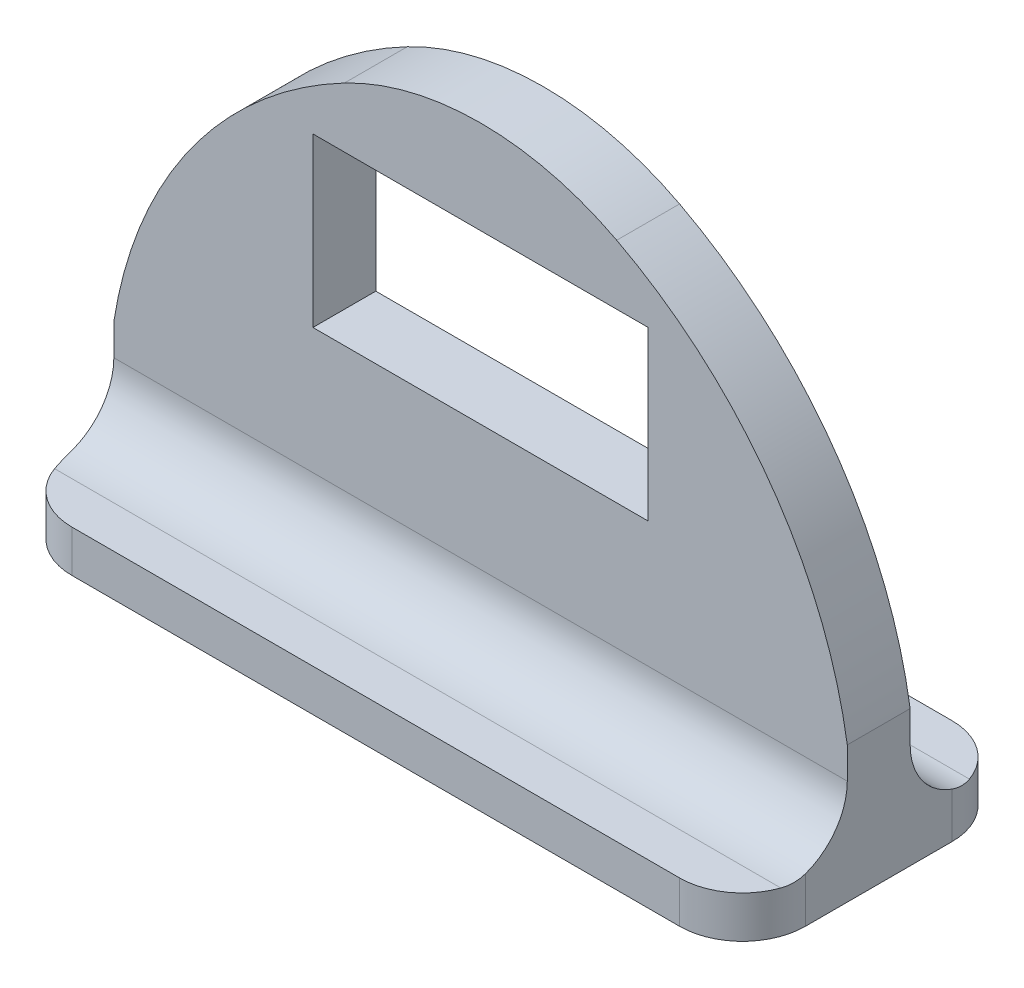
ISO-10303-21;
HEADER;
FILE_DESCRIPTION(('STEP AP214'),'2;1');
FILE_NAME('part.step','',(''),(''),'','','');
FILE_SCHEMA(('AUTOMOTIVE_DESIGN { 1 0 10303 214 1 1 1 1 }'));
ENDSEC;
DATA;
#1=APPLICATION_CONTEXT('core data for automotive mechanical design processes');
#2=APPLICATION_PROTOCOL_DEFINITION('international standard','automotive_design',2000,#1);
#3=PRODUCT_CONTEXT('',#1,'mechanical');
#4=PRODUCT('Part','Part','',(#3));
#5=PRODUCT_RELATED_PRODUCT_CATEGORY('part','',(#4));
#6=PRODUCT_DEFINITION_FORMATION('','',#4);
#7=PRODUCT_DEFINITION_CONTEXT('part definition',#1,'design');
#8=PRODUCT_DEFINITION('design','',#6,#7);
#9=PRODUCT_DEFINITION_SHAPE('','',#8);
#10=(LENGTH_UNIT() NAMED_UNIT(*) SI_UNIT(.MILLI.,.METRE.));
#11=(NAMED_UNIT(*) PLANE_ANGLE_UNIT() SI_UNIT($,.RADIAN.));
#12=(NAMED_UNIT(*) SI_UNIT($,.STERADIAN.) SOLID_ANGLE_UNIT());
#13=UNCERTAINTY_MEASURE_WITH_UNIT(LENGTH_MEASURE(1.E-05),#10,'distance_accuracy_value','');
#14=(GEOMETRIC_REPRESENTATION_CONTEXT(3) GLOBAL_UNCERTAINTY_ASSIGNED_CONTEXT((#13)) GLOBAL_UNIT_ASSIGNED_CONTEXT((#10,
#11,#12)) REPRESENTATION_CONTEXT('',''));
#15=CARTESIAN_POINT('',(0.,0.,0.));
#16=DIRECTION('',(0.,0.,1.));
#17=DIRECTION('',(1.,0.,0.));
#18=AXIS2_PLACEMENT_3D('',#15,#16,#17);
#19=CARTESIAN_POINT('',(0.,0.,0.));
#20=DIRECTION('',(0.,0.,1.));
#21=DIRECTION('',(1.,0.,0.));
#22=AXIS2_PLACEMENT_3D('',#19,#20,#21);
#23=PLANE('',#22);
#24=DIRECTION('',(1.,0.,0.));
#25=VECTOR('',#24,1.);
#26=CARTESIAN_POINT('',(0.,48.26,0.));
#27=LINE('',#26,#25);
#28=CARTESIAN_POINT('',(-20.32,48.26,0.));
#29=VERTEX_POINT('',#28);
#30=CARTESIAN_POINT('',(20.32,48.26,0.));
#31=VERTEX_POINT('',#30);
#32=EDGE_CURVE('E204',#29,#31,#27,.T.);
#33=ORIENTED_EDGE('',*,*,#32,.F.);
#34=DIRECTION('',(0.,-1.,0.));
#35=VECTOR('',#34,1.);
#36=CARTESIAN_POINT('',(-20.32,0.,0.));
#37=LINE('',#36,#35);
#38=CARTESIAN_POINT('',(-20.32,27.94,0.));
#39=VERTEX_POINT('',#38);
#40=EDGE_CURVE('E353',#29,#39,#37,.T.);
#41=ORIENTED_EDGE('',*,*,#40,.T.);
#42=DIRECTION('',(1.,0.,0.));
#43=VECTOR('',#42,1.);
#44=CARTESIAN_POINT('',(0.,27.94,0.));
#45=LINE('',#44,#43);
#46=CARTESIAN_POINT('',(20.32,27.94,0.));
#47=VERTEX_POINT('',#46);
#48=EDGE_CURVE('E350',#39,#47,#45,.T.);
#49=ORIENTED_EDGE('',*,*,#48,.T.);
#50=DIRECTION('',(0.,-1.,0.));
#51=VECTOR('',#50,1.);
#52=CARTESIAN_POINT('',(20.32,0.,0.));
#53=LINE('',#52,#51);
#54=EDGE_CURVE('E348',#31,#47,#53,.T.);
#55=ORIENTED_EDGE('',*,*,#54,.F.);
#56=EDGE_LOOP('',(#33,#41,#49,#55));
#57=FACE_BOUND('',#56,.T.);
#58=DIRECTION('',(0.,1.,0.));
#59=VECTOR('',#58,1.);
#60=CARTESIAN_POINT('',(44.45,0.,0.));
#61=LINE('',#60,#59);
#62=CARTESIAN_POINT('',(44.45,12.7,0.));
#63=VERTEX_POINT('',#62);
#64=CARTESIAN_POINT('',(44.45,16.5100000000001,0.));
#65=VERTEX_POINT('',#64);
#66=EDGE_CURVE('E200',#63,#65,#61,.T.);
#67=ORIENTED_EDGE('',*,*,#66,.F.);
#68=DIRECTION('',(1.,0.,0.));
#69=VECTOR('',#68,1.);
#70=CARTESIAN_POINT('',(-44.45,12.7,0.));
#71=LINE('',#70,#69);
#72=CARTESIAN_POINT('',(-44.45,12.7,0.));
#73=VERTEX_POINT('',#72);
#74=EDGE_CURVE('E217',#63,#73,#71,.F.);
#75=ORIENTED_EDGE('',*,*,#74,.T.);
#76=DIRECTION('',(0.,1.,0.));
#77=VECTOR('',#76,1.);
#78=CARTESIAN_POINT('',(-44.45,0.,0.));
#79=LINE('',#78,#77);
#80=CARTESIAN_POINT('',(-44.45,16.5099999999992,0.));
#81=VERTEX_POINT('',#80);
#82=EDGE_CURVE('E365',#73,#81,#79,.T.);
#83=ORIENTED_EDGE('',*,*,#82,.T.);
#84=CARTESIAN_POINT('',(8.25500000000054,8.25499999999961,0.));
#85=DIRECTION('',(0.,0.,1.));
#86=DIRECTION('',(1.,0.,0.));
#87=AXIS2_PLACEMENT_3D('',#84,#85,#86);
#88=CIRCLE('',#87,53.3475589882054);
#89=CARTESIAN_POINT('',(-16.5029839223391,55.5096747116218,0.));
#90=VERTEX_POINT('',#89);
#91=EDGE_CURVE('E362',#81,#90,#88,.F.);
#92=ORIENTED_EDGE('',*,*,#91,.T.);
#93=CARTESIAN_POINT('',(1.65485062510743E-13,24.0110220156887,0.));
#94=DIRECTION('',(0.,0.,1.));
#95=DIRECTION('',(1.,0.,0.));
#96=AXIS2_PLACEMENT_3D('',#93,#94,#95);
#97=CIRCLE('',#96,35.56);
#98=CARTESIAN_POINT('',(16.5029839223393,55.5096747116219,0.));
#99=VERTEX_POINT('',#98);
#100=EDGE_CURVE('E359',#99,#90,#97,.T.);
#101=ORIENTED_EDGE('',*,*,#100,.F.);
#102=CARTESIAN_POINT('',(-8.25499999999988,8.25500000000009,0.));
#103=DIRECTION('',(0.,0.,1.));
#104=DIRECTION('',(1.,0.,0.));
#105=AXIS2_PLACEMENT_3D('',#102,#103,#104);
#106=CIRCLE('',#105,53.3475589882048);
#107=EDGE_CURVE('E356',#99,#65,#106,.F.);
#108=ORIENTED_EDGE('',*,*,#107,.T.);
#109=EDGE_LOOP('',(#67,#75,#83,#92,#101,#108));
#110=FACE_BOUND('',#109,.T.);
#111=ADVANCED_FACE('F36',(#57,#110),#23,.F.);
#112=CARTESIAN_POINT('',(-8.25499999999988,8.25500000000009,7.62));
#113=DIRECTION('',(0.,0.,-1.));
#114=DIRECTION('',(-1.,0.,0.));
#115=AXIS2_PLACEMENT_3D('',#112,#113,#114);
#116=CYLINDRICAL_SURFACE('',#115,53.3475589882048);
#117=ORIENTED_EDGE('',*,*,#107,.F.);
#118=DIRECTION('',(0.,0.,-1.));
#119=VECTOR('',#118,1.);
#120=CARTESIAN_POINT('',(16.5029839223393,55.5096747116219,7.62));
#121=LINE('',#120,#119);
#122=CARTESIAN_POINT('',(16.5029839223393,55.5096747116219,7.62));
#123=VERTEX_POINT('',#122);
#124=EDGE_CURVE('E218',#123,#99,#121,.T.);
#125=ORIENTED_EDGE('',*,*,#124,.F.);
#126=CARTESIAN_POINT('',(-8.25499999999988,8.25500000000009,7.62));
#127=DIRECTION('',(0.,0.,1.));
#128=DIRECTION('',(1.,0.,0.));
#129=AXIS2_PLACEMENT_3D('',#126,#127,#128);
#130=CIRCLE('',#129,53.3475589882048);
#131=CARTESIAN_POINT('',(44.45,16.5100000000001,7.62));
#132=VERTEX_POINT('',#131);
#133=EDGE_CURVE('E335',#123,#132,#130,.F.);
#134=ORIENTED_EDGE('',*,*,#133,.T.);
#135=DIRECTION('',(0.,0.,-1.));
#136=VECTOR('',#135,1.);
#137=CARTESIAN_POINT('',(44.45,16.5100000000001,7.62));
#138=LINE('',#137,#136);
#139=EDGE_CURVE('E205',#132,#65,#138,.T.);
#140=ORIENTED_EDGE('',*,*,#139,.T.);
#141=EDGE_LOOP('',(#117,#125,#134,#140));
#142=FACE_BOUND('',#141,.T.);
#143=ADVANCED_FACE('F387',(#142),#116,.T.);
#144=CARTESIAN_POINT('',(1.65485062510743E-13,24.0110220156887,7.62));
#145=DIRECTION('',(0.,0.,-1.));
#146=DIRECTION('',(-1.,0.,0.));
#147=AXIS2_PLACEMENT_3D('',#144,#145,#146);
#148=CYLINDRICAL_SURFACE('',#147,35.56);
#149=ORIENTED_EDGE('',*,*,#100,.T.);
#150=DIRECTION('',(0.,0.,-1.));
#151=VECTOR('',#150,1.);
#152=CARTESIAN_POINT('',(-16.5029839223391,55.5096747116218,7.62));
#153=LINE('',#152,#151);
#154=CARTESIAN_POINT('',(-16.5029839223391,55.5096747116218,7.62));
#155=VERTEX_POINT('',#154);
#156=EDGE_CURVE('E375',#155,#90,#153,.T.);
#157=ORIENTED_EDGE('',*,*,#156,.F.);
#158=CARTESIAN_POINT('',(1.65485062510743E-13,24.0110220156887,7.62));
#159=DIRECTION('',(0.,0.,1.));
#160=DIRECTION('',(1.,0.,0.));
#161=AXIS2_PLACEMENT_3D('',#158,#159,#160);
#162=CIRCLE('',#161,35.56);
#163=EDGE_CURVE('E338',#123,#155,#162,.T.);
#164=ORIENTED_EDGE('',*,*,#163,.F.);
#165=ORIENTED_EDGE('',*,*,#124,.T.);
#166=EDGE_LOOP('',(#149,#157,#164,#165));
#167=FACE_BOUND('',#166,.T.);
#168=ADVANCED_FACE('F433',(#167),#148,.T.);
#169=CARTESIAN_POINT('',(8.25500000000054,8.25499999999961,7.62));
#170=DIRECTION('',(0.,0.,-1.));
#171=DIRECTION('',(-1.,0.,0.));
#172=AXIS2_PLACEMENT_3D('',#169,#170,#171);
#173=CYLINDRICAL_SURFACE('',#172,53.3475589882054);
#174=ORIENTED_EDGE('',*,*,#91,.F.);
#175=DIRECTION('',(0.,0.,-1.));
#176=VECTOR('',#175,1.);
#177=CARTESIAN_POINT('',(-44.45,16.5099999999992,7.62));
#178=LINE('',#177,#176);
#179=CARTESIAN_POINT('',(-44.45,16.5099999999992,7.62));
#180=VERTEX_POINT('',#179);
#181=EDGE_CURVE('E372',#180,#81,#178,.T.);
#182=ORIENTED_EDGE('',*,*,#181,.F.);
#183=CARTESIAN_POINT('',(8.25500000000054,8.25499999999961,7.62));
#184=DIRECTION('',(0.,0.,1.));
#185=DIRECTION('',(1.,0.,0.));
#186=AXIS2_PLACEMENT_3D('',#183,#184,#185);
#187=CIRCLE('',#186,53.3475589882054);
#188=EDGE_CURVE('E340',#180,#155,#187,.F.);
#189=ORIENTED_EDGE('',*,*,#188,.T.);
#190=ORIENTED_EDGE('',*,*,#156,.T.);
#191=EDGE_LOOP('',(#174,#182,#189,#190));
#192=FACE_BOUND('',#191,.T.);
#193=ADVANCED_FACE('F430',(#192),#173,.T.);
#194=CARTESIAN_POINT('',(-44.45,0.,7.62));
#195=DIRECTION('',(-1.,0.,0.));
#196=DIRECTION('',(0.,0.,1.));
#197=AXIS2_PLACEMENT_3D('',#194,#195,#196);
#198=PLANE('',#197);
#199=CARTESIAN_POINT('',(-44.45,12.7,-7.62));
#200=DIRECTION('',(-1.,0.,0.));
#201=DIRECTION('',(0.,0.,1.));
#202=AXIS2_PLACEMENT_3D('',#199,#200,#201);
#203=CIRCLE('',#202,7.62);
#204=CARTESIAN_POINT('',(-44.45,5.51579510314468,-5.08));
#205=VERTEX_POINT('',#204);
#206=EDGE_CURVE('E239',#73,#205,#203,.F.);
#207=ORIENTED_EDGE('',*,*,#206,.T.);
#208=DIRECTION('',(0.,1.,0.));
#209=VECTOR('',#208,1.);
#210=CARTESIAN_POINT('',(-44.45,0.,-5.08));
#211=LINE('',#210,#209);
#212=CARTESIAN_POINT('',(-44.45,0.,-5.08));
#213=VERTEX_POINT('',#212);
#214=EDGE_CURVE('E299',#205,#213,#211,.F.);
#215=ORIENTED_EDGE('',*,*,#214,.T.);
#216=DIRECTION('',(0.,0.,-1.));
#217=VECTOR('',#216,1.);
#218=CARTESIAN_POINT('',(-44.45,0.,7.62));
#219=LINE('',#218,#217);
#220=CARTESIAN_POINT('',(-44.45,0.,12.7));
#221=VERTEX_POINT('',#220);
#222=EDGE_CURVE('E369',#221,#213,#219,.T.);
#223=ORIENTED_EDGE('',*,*,#222,.F.);
#224=DIRECTION('',(0.,-1.,0.));
#225=VECTOR('',#224,1.);
#226=CARTESIAN_POINT('',(-44.45,5.07999999999999,12.7));
#227=LINE('',#226,#225);
#228=CARTESIAN_POINT('',(-44.45,5.51579510314453,12.7));
#229=VERTEX_POINT('',#228);
#230=EDGE_CURVE('E65',#221,#229,#227,.F.);
#231=ORIENTED_EDGE('',*,*,#230,.T.);
#232=CARTESIAN_POINT('',(-44.45,12.7,15.24));
#233=DIRECTION('',(-1.,0.,0.));
#234=DIRECTION('',(0.,0.,1.));
#235=AXIS2_PLACEMENT_3D('',#232,#233,#234);
#236=CIRCLE('',#235,7.62);
#237=CARTESIAN_POINT('',(-44.45,12.7,7.62));
#238=VERTEX_POINT('',#237);
#239=EDGE_CURVE('E298',#229,#238,#236,.F.);
#240=ORIENTED_EDGE('',*,*,#239,.T.);
#241=DIRECTION('',(0.,1.,0.));
#242=VECTOR('',#241,1.);
#243=CARTESIAN_POINT('',(-44.45,0.,7.62));
#244=LINE('',#243,#242);
#245=EDGE_CURVE('E343',#238,#180,#244,.T.);
#246=ORIENTED_EDGE('',*,*,#245,.T.);
#247=ORIENTED_EDGE('',*,*,#181,.T.);
#248=ORIENTED_EDGE('',*,*,#82,.F.);
#249=EDGE_LOOP('',(#207,#215,#223,#231,#240,#246,#247,#248));
#250=FACE_BOUND('',#249,.T.);
#251=ADVANCED_FACE('F400',(#250),#198,.T.);
#252=CARTESIAN_POINT('',(0.,0.,7.62));
#253=DIRECTION('',(0.,1.,0.));
#254=DIRECTION('',(-1.,0.,0.));
#255=AXIS2_PLACEMENT_3D('',#252,#253,#254);
#256=PLANE('',#255);
#257=DIRECTION('',(-1.,0.,0.));
#258=VECTOR('',#257,1.);
#259=CARTESIAN_POINT('',(44.45,0.,-12.7));
#260=LINE('',#259,#258);
#261=CARTESIAN_POINT('',(36.83,0.,-12.7));
#262=VERTEX_POINT('',#261);
#263=CARTESIAN_POINT('',(-36.83,0.,-12.7));
#264=VERTEX_POINT('',#263);
#265=EDGE_CURVE('E322',#262,#264,#260,.T.);
#266=ORIENTED_EDGE('',*,*,#265,.F.);
#267=CARTESIAN_POINT('',(36.83,0.,-5.08));
#268=DIRECTION('',(0.,1.,0.));
#269=DIRECTION('',(-1.,0.,0.));
#270=AXIS2_PLACEMENT_3D('',#267,#268,#269);
#271=CIRCLE('',#270,7.62);
#272=CARTESIAN_POINT('',(44.45,0.,-5.08));
#273=VERTEX_POINT('',#272);
#274=EDGE_CURVE('E255',#262,#273,#271,.F.);
#275=ORIENTED_EDGE('',*,*,#274,.T.);
#276=DIRECTION('',(0.,0.,-1.));
#277=VECTOR('',#276,1.);
#278=CARTESIAN_POINT('',(44.45,0.,7.62));
#279=LINE('',#278,#277);
#280=CARTESIAN_POINT('',(44.45,0.,12.7));
#281=VERTEX_POINT('',#280);
#282=EDGE_CURVE('E208',#281,#273,#279,.T.);
#283=ORIENTED_EDGE('',*,*,#282,.F.);
#284=CARTESIAN_POINT('',(36.83,0.,12.7));
#285=DIRECTION('',(0.,1.,0.));
#286=DIRECTION('',(-1.,0.,0.));
#287=AXIS2_PLACEMENT_3D('',#284,#285,#286);
#288=CIRCLE('',#287,7.62);
#289=CARTESIAN_POINT('',(36.83,0.,20.32));
#290=VERTEX_POINT('',#289);
#291=EDGE_CURVE('E234',#281,#290,#288,.F.);
#292=ORIENTED_EDGE('',*,*,#291,.T.);
#293=DIRECTION('',(1.,0.,0.));
#294=VECTOR('',#293,1.);
#295=CARTESIAN_POINT('',(-44.45,0.,20.32));
#296=LINE('',#295,#294);
#297=CARTESIAN_POINT('',(-36.83,0.,20.32));
#298=VERTEX_POINT('',#297);
#299=EDGE_CURVE('E323',#298,#290,#296,.T.);
#300=ORIENTED_EDGE('',*,*,#299,.F.);
#301=CARTESIAN_POINT('',(-36.83,0.,12.7));
#302=DIRECTION('',(0.,1.,0.));
#303=DIRECTION('',(-1.,0.,0.));
#304=AXIS2_PLACEMENT_3D('',#301,#302,#303);
#305=CIRCLE('',#304,7.62);
#306=EDGE_CURVE('E232',#298,#221,#305,.F.);
#307=ORIENTED_EDGE('',*,*,#306,.T.);
#308=ORIENTED_EDGE('',*,*,#222,.T.);
#309=CARTESIAN_POINT('',(-36.83,0.,-5.08));
#310=DIRECTION('',(0.,1.,0.));
#311=DIRECTION('',(-1.,0.,0.));
#312=AXIS2_PLACEMENT_3D('',#309,#310,#311);
#313=CIRCLE('',#312,7.62);
#314=EDGE_CURVE('E253',#213,#264,#313,.F.);
#315=ORIENTED_EDGE('',*,*,#314,.T.);
#316=EDGE_LOOP('',(#266,#275,#283,#292,#300,#307,#308,#315));
#317=FACE_BOUND('',#316,.T.);
#318=ADVANCED_FACE('F418',(#317),#256,.F.);
#319=CARTESIAN_POINT('',(0.,48.26,7.62));
#320=DIRECTION('',(0.,1.,0.));
#321=DIRECTION('',(0.,0.,1.));
#322=AXIS2_PLACEMENT_3D('',#319,#320,#321);
#323=PLANE('',#322);
#324=ORIENTED_EDGE('',*,*,#32,.T.);
#325=DIRECTION('',(0.,0.,-1.));
#326=VECTOR('',#325,1.);
#327=CARTESIAN_POINT('',(20.32,48.26,7.62));
#328=LINE('',#327,#326);
#329=CARTESIAN_POINT('',(20.32,48.26,7.62));
#330=VERTEX_POINT('',#329);
#331=EDGE_CURVE('E185',#330,#31,#328,.T.);
#332=ORIENTED_EDGE('',*,*,#331,.F.);
#333=DIRECTION('',(1.,0.,0.));
#334=VECTOR('',#333,1.);
#335=CARTESIAN_POINT('',(0.,48.26,7.62));
#336=LINE('',#335,#334);
#337=CARTESIAN_POINT('',(-20.32,48.26,7.62));
#338=VERTEX_POINT('',#337);
#339=EDGE_CURVE('E192',#338,#330,#336,.T.);
#340=ORIENTED_EDGE('',*,*,#339,.F.);
#341=DIRECTION('',(0.,0.,-1.));
#342=VECTOR('',#341,1.);
#343=CARTESIAN_POINT('',(-20.32,48.26,7.62));
#344=LINE('',#343,#342);
#345=EDGE_CURVE('E346',#338,#29,#344,.T.);
#346=ORIENTED_EDGE('',*,*,#345,.T.);
#347=EDGE_LOOP('',(#324,#332,#340,#346));
#348=FACE_BOUND('',#347,.T.);
#349=ADVANCED_FACE('F202',(#348),#323,.F.);
#350=CARTESIAN_POINT('',(20.32,0.,7.62));
#351=DIRECTION('',(1.,0.,0.));
#352=DIRECTION('',(0.,1.,0.));
#353=AXIS2_PLACEMENT_3D('',#350,#351,#352);
#354=PLANE('',#353);
#355=ORIENTED_EDGE('',*,*,#54,.T.);
#356=DIRECTION('',(0.,0.,-1.));
#357=VECTOR('',#356,1.);
#358=CARTESIAN_POINT('',(20.32,27.94,7.62));
#359=LINE('',#358,#357);
#360=CARTESIAN_POINT('',(20.32,27.94,7.62));
#361=VERTEX_POINT('',#360);
#362=EDGE_CURVE('E187',#361,#47,#359,.T.);
#363=ORIENTED_EDGE('',*,*,#362,.F.);
#364=DIRECTION('',(0.,-1.,0.));
#365=VECTOR('',#364,1.);
#366=CARTESIAN_POINT('',(20.32,0.,7.62));
#367=LINE('',#366,#365);
#368=EDGE_CURVE('E180',#330,#361,#367,.T.);
#369=ORIENTED_EDGE('',*,*,#368,.F.);
#370=ORIENTED_EDGE('',*,*,#331,.T.);
#371=EDGE_LOOP('',(#355,#363,#369,#370));
#372=FACE_BOUND('',#371,.T.);
#373=ADVANCED_FACE('F183',(#372),#354,.F.);
#374=CARTESIAN_POINT('',(0.,27.94,7.62));
#375=DIRECTION('',(0.,1.,0.));
#376=DIRECTION('',(0.,0.,1.));
#377=AXIS2_PLACEMENT_3D('',#374,#375,#376);
#378=PLANE('',#377);
#379=ORIENTED_EDGE('',*,*,#48,.F.);
#380=DIRECTION('',(0.,0.,-1.));
#381=VECTOR('',#380,1.);
#382=CARTESIAN_POINT('',(-20.32,27.94,7.62));
#383=LINE('',#382,#381);
#384=CARTESIAN_POINT('',(-20.32,27.94,7.62));
#385=VERTEX_POINT('',#384);
#386=EDGE_CURVE('E210',#385,#39,#383,.T.);
#387=ORIENTED_EDGE('',*,*,#386,.F.);
#388=DIRECTION('',(1.,0.,0.));
#389=VECTOR('',#388,1.);
#390=CARTESIAN_POINT('',(0.,27.94,7.62));
#391=LINE('',#390,#389);
#392=EDGE_CURVE('E191',#385,#361,#391,.T.);
#393=ORIENTED_EDGE('',*,*,#392,.T.);
#394=ORIENTED_EDGE('',*,*,#362,.T.);
#395=EDGE_LOOP('',(#379,#387,#393,#394));
#396=FACE_BOUND('',#395,.T.);
#397=ADVANCED_FACE('F383',(#396),#378,.T.);
#398=CARTESIAN_POINT('',(-20.32,0.,7.62));
#399=DIRECTION('',(1.,0.,0.));
#400=DIRECTION('',(0.,1.,0.));
#401=AXIS2_PLACEMENT_3D('',#398,#399,#400);
#402=PLANE('',#401);
#403=ORIENTED_EDGE('',*,*,#40,.F.);
#404=ORIENTED_EDGE('',*,*,#345,.F.);
#405=DIRECTION('',(0.,-1.,0.));
#406=VECTOR('',#405,1.);
#407=CARTESIAN_POINT('',(-20.32,0.,7.62));
#408=LINE('',#407,#406);
#409=EDGE_CURVE('E198',#338,#385,#408,.T.);
#410=ORIENTED_EDGE('',*,*,#409,.T.);
#411=ORIENTED_EDGE('',*,*,#386,.T.);
#412=EDGE_LOOP('',(#403,#404,#410,#411));
#413=FACE_BOUND('',#412,.T.);
#414=ADVANCED_FACE('F381',(#413),#402,.T.);
#415=CARTESIAN_POINT('',(44.45,0.,7.62));
#416=DIRECTION('',(-1.,0.,0.));
#417=DIRECTION('',(0.,0.,1.));
#418=AXIS2_PLACEMENT_3D('',#415,#416,#417);
#419=PLANE('',#418);
#420=ORIENTED_EDGE('',*,*,#282,.T.);
#421=DIRECTION('',(0.,-1.,0.));
#422=VECTOR('',#421,1.);
#423=CARTESIAN_POINT('',(44.45,0.,-5.08));
#424=LINE('',#423,#422);
#425=CARTESIAN_POINT('',(44.45,5.51579510314468,-5.08));
#426=VERTEX_POINT('',#425);
#427=EDGE_CURVE('E257',#273,#426,#424,.F.);
#428=ORIENTED_EDGE('',*,*,#427,.T.);
#429=CARTESIAN_POINT('',(44.45,12.7,-7.62));
#430=DIRECTION('',(-1.,0.,0.));
#431=DIRECTION('',(0.,0.,1.));
#432=AXIS2_PLACEMENT_3D('',#429,#430,#431);
#433=CIRCLE('',#432,7.62);
#434=EDGE_CURVE('E237',#426,#63,#433,.T.);
#435=ORIENTED_EDGE('',*,*,#434,.T.);
#436=ORIENTED_EDGE('',*,*,#66,.T.);
#437=ORIENTED_EDGE('',*,*,#139,.F.);
#438=DIRECTION('',(0.,1.,0.));
#439=VECTOR('',#438,1.);
#440=CARTESIAN_POINT('',(44.45,0.,7.62));
#441=LINE('',#440,#439);
#442=CARTESIAN_POINT('',(44.45,12.7,7.62));
#443=VERTEX_POINT('',#442);
#444=EDGE_CURVE('E309',#443,#132,#441,.T.);
#445=ORIENTED_EDGE('',*,*,#444,.F.);
#446=CARTESIAN_POINT('',(44.45,12.7,15.24));
#447=DIRECTION('',(-1.,0.,0.));
#448=DIRECTION('',(0.,0.,1.));
#449=AXIS2_PLACEMENT_3D('',#446,#447,#448);
#450=CIRCLE('',#449,7.62);
#451=CARTESIAN_POINT('',(44.45,5.51579510314453,12.7));
#452=VERTEX_POINT('',#451);
#453=EDGE_CURVE('E51',#443,#452,#450,.T.);
#454=ORIENTED_EDGE('',*,*,#453,.T.);
#455=DIRECTION('',(0.,1.,0.));
#456=VECTOR('',#455,1.);
#457=CARTESIAN_POINT('',(44.45,0.,12.7));
#458=LINE('',#457,#456);
#459=EDGE_CURVE('E57',#452,#281,#458,.F.);
#460=ORIENTED_EDGE('',*,*,#459,.T.);
#461=EDGE_LOOP('',(#420,#428,#435,#436,#437,#445,#454,#460));
#462=FACE_BOUND('',#461,.T.);
#463=ADVANCED_FACE('F306',(#462),#419,.F.);
#464=CARTESIAN_POINT('',(0.,0.,7.62));
#465=DIRECTION('',(0.,0.,1.));
#466=DIRECTION('',(1.,0.,0.));
#467=AXIS2_PLACEMENT_3D('',#464,#465,#466);
#468=PLANE('',#467);
#469=ORIENTED_EDGE('',*,*,#245,.F.);
#470=DIRECTION('',(-1.,0.,0.));
#471=VECTOR('',#470,1.);
#472=CARTESIAN_POINT('',(0.,12.7,7.62));
#473=LINE('',#472,#471);
#474=EDGE_CURVE('E245',#238,#443,#473,.F.);
#475=ORIENTED_EDGE('',*,*,#474,.T.);
#476=ORIENTED_EDGE('',*,*,#444,.T.);
#477=ORIENTED_EDGE('',*,*,#133,.F.);
#478=ORIENTED_EDGE('',*,*,#163,.T.);
#479=ORIENTED_EDGE('',*,*,#188,.F.);
#480=EDGE_LOOP('',(#469,#475,#476,#477,#478,#479));
#481=FACE_BOUND('',#480,.T.);
#482=ORIENTED_EDGE('',*,*,#339,.T.);
#483=ORIENTED_EDGE('',*,*,#368,.T.);
#484=ORIENTED_EDGE('',*,*,#392,.F.);
#485=ORIENTED_EDGE('',*,*,#409,.F.);
#486=EDGE_LOOP('',(#482,#483,#484,#485));
#487=FACE_BOUND('',#486,.T.);
#488=ADVANCED_FACE('F196',(#481,#487),#468,.T.);
#489=CARTESIAN_POINT('',(44.45,5.08,-12.7));
#490=DIRECTION('',(0.,-1.,0.));
#491=DIRECTION('',(0.,0.,-1.));
#492=AXIS2_PLACEMENT_3D('',#489,#490,#491);
#493=PLANE('',#492);
#494=DIRECTION('',(1.,0.,0.));
#495=VECTOR('',#494,1.);
#496=CARTESIAN_POINT('',(44.45,5.08,-7.62));
#497=LINE('',#496,#495);
#498=CARTESIAN_POINT('',(-44.0142048968553,5.08,-7.62));
#499=VERTEX_POINT('',#498);
#500=CARTESIAN_POINT('',(44.0142048968553,5.08,-7.62));
#501=VERTEX_POINT('',#500);
#502=EDGE_CURVE('E214',#499,#501,#497,.T.);
#503=ORIENTED_EDGE('',*,*,#502,.T.);
#504=CARTESIAN_POINT('',(36.83,5.08,-5.08));
#505=DIRECTION('',(0.,-1.,0.));
#506=DIRECTION('',(0.,0.,-1.));
#507=AXIS2_PLACEMENT_3D('',#504,#505,#506);
#508=CIRCLE('',#507,7.62);
#509=CARTESIAN_POINT('',(36.83,5.08,-12.7));
#510=VERTEX_POINT('',#509);
#511=EDGE_CURVE('E404',#501,#510,#508,.F.);
#512=ORIENTED_EDGE('',*,*,#511,.T.);
#513=DIRECTION('',(1.,0.,0.));
#514=VECTOR('',#513,1.);
#515=CARTESIAN_POINT('',(44.45,5.08,-12.7));
#516=LINE('',#515,#514);
#517=CARTESIAN_POINT('',(-36.83,5.08,-12.7));
#518=VERTEX_POINT('',#517);
#519=EDGE_CURVE('E326',#518,#510,#516,.T.);
#520=ORIENTED_EDGE('',*,*,#519,.F.);
#521=CARTESIAN_POINT('',(-36.83,5.08,-5.08));
#522=DIRECTION('',(0.,-1.,0.));
#523=DIRECTION('',(0.,0.,-1.));
#524=AXIS2_PLACEMENT_3D('',#521,#522,#523);
#525=CIRCLE('',#524,7.62);
#526=EDGE_CURVE('E405',#518,#499,#525,.F.);
#527=ORIENTED_EDGE('',*,*,#526,.T.);
#528=EDGE_LOOP('',(#503,#512,#520,#527));
#529=FACE_BOUND('',#528,.T.);
#530=ADVANCED_FACE('F411',(#529),#493,.F.);
#531=CARTESIAN_POINT('',(0.,0.,-12.7));
#532=DIRECTION('',(0.,0.,1.));
#533=DIRECTION('',(1.,0.,0.));
#534=AXIS2_PLACEMENT_3D('',#531,#532,#533);
#535=PLANE('',#534);
#536=ORIENTED_EDGE('',*,*,#519,.T.);
#537=DIRECTION('',(0.,-1.,0.));
#538=VECTOR('',#537,1.);
#539=CARTESIAN_POINT('',(36.83,0.,-12.7));
#540=LINE('',#539,#538);
#541=EDGE_CURVE('E250',#510,#262,#540,.T.);
#542=ORIENTED_EDGE('',*,*,#541,.T.);
#543=ORIENTED_EDGE('',*,*,#265,.T.);
#544=DIRECTION('',(0.,1.,0.));
#545=VECTOR('',#544,1.);
#546=CARTESIAN_POINT('',(-36.83,5.08,-12.7));
#547=LINE('',#546,#545);
#548=EDGE_CURVE('E247',#264,#518,#547,.T.);
#549=ORIENTED_EDGE('',*,*,#548,.T.);
#550=EDGE_LOOP('',(#536,#542,#543,#549));
#551=FACE_BOUND('',#550,.T.);
#552=ADVANCED_FACE('F416',(#551),#535,.F.);
#553=CARTESIAN_POINT('',(-44.45,5.07999999999999,20.32));
#554=DIRECTION('',(0.,-1.,0.));
#555=DIRECTION('',(0.,0.,-1.));
#556=AXIS2_PLACEMENT_3D('',#553,#554,#555);
#557=PLANE('',#556);
#558=CARTESIAN_POINT('',(36.83,5.07999999999999,12.7));
#559=DIRECTION('',(0.,-1.,0.));
#560=DIRECTION('',(0.,0.,-1.));
#561=AXIS2_PLACEMENT_3D('',#558,#559,#560);
#562=CIRCLE('',#561,7.62);
#563=CARTESIAN_POINT('',(36.83,5.07999999999999,20.32));
#564=VERTEX_POINT('',#563);
#565=CARTESIAN_POINT('',(44.0142048968553,5.07999999999999,15.24));
#566=VERTEX_POINT('',#565);
#567=EDGE_CURVE('E228',#564,#566,#562,.F.);
#568=ORIENTED_EDGE('',*,*,#567,.T.);
#569=DIRECTION('',(-1.,0.,0.));
#570=VECTOR('',#569,1.);
#571=CARTESIAN_POINT('',(-44.45,5.07999999999999,15.24));
#572=LINE('',#571,#570);
#573=CARTESIAN_POINT('',(-44.0142048968553,5.07999999999999,15.24));
#574=VERTEX_POINT('',#573);
#575=EDGE_CURVE('E242',#566,#574,#572,.T.);
#576=ORIENTED_EDGE('',*,*,#575,.T.);
#577=CARTESIAN_POINT('',(-36.83,5.07999999999999,12.7));
#578=DIRECTION('',(0.,-1.,0.));
#579=DIRECTION('',(0.,0.,-1.));
#580=AXIS2_PLACEMENT_3D('',#577,#578,#579);
#581=CIRCLE('',#580,7.62);
#582=CARTESIAN_POINT('',(-36.83,5.07999999999999,20.32));
#583=VERTEX_POINT('',#582);
#584=EDGE_CURVE('E226',#574,#583,#581,.F.);
#585=ORIENTED_EDGE('',*,*,#584,.T.);
#586=DIRECTION('',(-1.,0.,0.));
#587=VECTOR('',#586,1.);
#588=CARTESIAN_POINT('',(-44.45,5.07999999999999,20.32));
#589=LINE('',#588,#587);
#590=EDGE_CURVE('E319',#564,#583,#589,.T.);
#591=ORIENTED_EDGE('',*,*,#590,.F.);
#592=EDGE_LOOP('',(#568,#576,#585,#591));
#593=FACE_BOUND('',#592,.T.);
#594=ADVANCED_FACE('F316',(#593),#557,.F.);
#595=CARTESIAN_POINT('',(0.,0.,20.32));
#596=DIRECTION('',(0.,0.,-1.));
#597=DIRECTION('',(-1.,0.,0.));
#598=AXIS2_PLACEMENT_3D('',#595,#596,#597);
#599=PLANE('',#598);
#600=ORIENTED_EDGE('',*,*,#299,.T.);
#601=DIRECTION('',(0.,1.,0.));
#602=VECTOR('',#601,1.);
#603=CARTESIAN_POINT('',(36.83,0.,20.32));
#604=LINE('',#603,#602);
#605=EDGE_CURVE('E223',#290,#564,#604,.T.);
#606=ORIENTED_EDGE('',*,*,#605,.T.);
#607=ORIENTED_EDGE('',*,*,#590,.T.);
#608=DIRECTION('',(0.,-1.,0.));
#609=VECTOR('',#608,1.);
#610=CARTESIAN_POINT('',(-36.83,0.,20.32));
#611=LINE('',#610,#609);
#612=EDGE_CURVE('E220',#583,#298,#611,.T.);
#613=ORIENTED_EDGE('',*,*,#612,.T.);
#614=EDGE_LOOP('',(#600,#606,#607,#613));
#615=FACE_BOUND('',#614,.T.);
#616=ADVANCED_FACE('F277',(#615),#599,.F.);
#617=CARTESIAN_POINT('',(44.45,12.7,-7.62));
#618=DIRECTION('',(-1.,0.,0.));
#619=DIRECTION('',(0.,0.,1.));
#620=AXIS2_PLACEMENT_3D('',#617,#618,#619);
#621=CYLINDRICAL_SURFACE('',#620,7.62);
#622=ORIENTED_EDGE('',*,*,#434,.F.);
#623=CARTESIAN_POINT('',(44.45,5.51579510314468,-5.08));
#624=CARTESIAN_POINT('',(44.4500302876797,5.46332143403402,-5.22832111934065));
#625=CARTESIAN_POINT('',(44.4456704119371,5.41549393718708,-5.37830829780312));
#626=CARTESIAN_POINT('',(44.427801314776,5.3292907390266,-5.68051200079075));
#627=CARTESIAN_POINT('',(44.4142877987416,5.2909194858312,-5.83272953892282));
#628=CARTESIAN_POINT('',(44.3781039117108,5.22450271508616,-6.13512255216747));
#629=CARTESIAN_POINT('',(44.3556203664532,5.19626758919609,-6.2852786933208));
#630=CARTESIAN_POINT('',(44.30139315009,5.14905214551056,-6.58529054626812));
#631=CARTESIAN_POINT('',(44.2696546936152,5.13006663211451,-6.73514637952481));
#632=CARTESIAN_POINT('',(44.2032111731616,5.10362159013676,-7.00777207609704));
#633=CARTESIAN_POINT('',(44.1699578553521,5.09474034714589,-7.13076291414688));
#634=CARTESIAN_POINT('',(44.0969387404766,5.0828986941056,-7.37621003032751));
#635=CARTESIAN_POINT('',(44.0571207877802,5.07998843896249,-7.49865322836894));
#636=CARTESIAN_POINT('',(44.0142048968553,5.07999999999998,-7.62));
#637=B_SPLINE_CURVE_WITH_KNOTS('',3,(#623,#624,#625,#626,#627,#628,#629,#630,#631,#632,#633,
#634,#635,#636),.UNSPECIFIED.,.F.,.F.,(4,2,2,2,2,2,4),(0.,0.471884459099769,0.943990465842038,
1.40673795180012,1.86922520728088,2.2520801118104,2.63813795650818),.UNSPECIFIED.);
#638=EDGE_CURVE('E266',#426,#501,#637,.T.);
#639=ORIENTED_EDGE('',*,*,#638,.T.);
#640=ORIENTED_EDGE('',*,*,#502,.F.);
#641=CARTESIAN_POINT('',(-44.0142048968553,5.08,-7.62));
#642=CARTESIAN_POINT('',(-44.066678565966,5.07996971232033,-7.47167888065935));
#643=CARTESIAN_POINT('',(-44.1145060628129,5.08432958806294,-7.32169170219688));
#644=CARTESIAN_POINT('',(-44.2007092609734,5.10219868522403,-7.01948799920925));
#645=CARTESIAN_POINT('',(-44.2390805141688,5.11571220125835,-6.86727046107718));
#646=CARTESIAN_POINT('',(-44.3054972849138,5.15189608828916,-6.56487744783253));
#647=CARTESIAN_POINT('',(-44.3337324108039,5.17437963354681,-6.4147213066792));
#648=CARTESIAN_POINT('',(-44.3809478544894,5.22860684991002,-6.11470945373188));
#649=CARTESIAN_POINT('',(-44.3999333678855,5.26034530638481,-5.96485362047519));
#650=CARTESIAN_POINT('',(-44.4263784098632,5.32678882683839,-5.69222792390296));
#651=CARTESIAN_POINT('',(-44.4352596528541,5.36004214464786,-5.56923708585312));
#652=CARTESIAN_POINT('',(-44.4471013058944,5.43306125952338,-5.32378996967249));
#653=CARTESIAN_POINT('',(-44.4500115610375,5.47287921221985,-5.20134677163106));
#654=CARTESIAN_POINT('',(-44.45,5.51579510314466,-5.08));
#655=B_SPLINE_CURVE_WITH_KNOTS('',3,(#641,#642,#643,#644,#645,#646,#647,#648,#649,#650,#651,
#652,#653,#654),.UNSPECIFIED.,.F.,.F.,(4,2,2,2,2,2,4),(0.,0.47188445909977,0.943990465842038,
1.40673795180012,1.86922520728088,2.25208011181041,2.63813795650818),.UNSPECIFIED.);
#656=EDGE_CURVE('E259',#499,#205,#655,.T.);
#657=ORIENTED_EDGE('',*,*,#656,.T.);
#658=ORIENTED_EDGE('',*,*,#206,.F.);
#659=ORIENTED_EDGE('',*,*,#74,.F.);
#660=EDGE_LOOP('',(#622,#639,#640,#657,#658,#659));
#661=FACE_BOUND('',#660,.T.);
#662=ADVANCED_FACE('F272',(#661),#621,.F.);
#663=CARTESIAN_POINT('',(36.83,0.,12.7));
#664=DIRECTION('',(0.,1.,0.));
#665=DIRECTION('',(0.,0.,1.));
#666=AXIS2_PLACEMENT_3D('',#663,#664,#665);
#667=CYLINDRICAL_SURFACE('',#666,7.62);
#668=ORIENTED_EDGE('',*,*,#291,.F.);
#669=ORIENTED_EDGE('',*,*,#459,.F.);
#670=CARTESIAN_POINT('',(44.45,5.51579510314453,12.7));
#671=CARTESIAN_POINT('',(44.4500302876797,5.46332143403396,12.8483211193407));
#672=CARTESIAN_POINT('',(44.4456704119371,5.41549393718705,12.9983082978032));
#673=CARTESIAN_POINT('',(44.427801314776,5.32929073902659,13.3005120007908));
#674=CARTESIAN_POINT('',(44.4142877987416,5.29091948583119,13.4527295389228));
#675=CARTESIAN_POINT('',(44.3781039117108,5.22450271508615,13.7551225521675));
#676=CARTESIAN_POINT('',(44.3556203664532,5.19626758919608,13.9052786933208));
#677=CARTESIAN_POINT('',(44.30139315009,5.14905214551055,14.2052905462681));
#678=CARTESIAN_POINT('',(44.2696546936152,5.1300666321145,14.3551463795248));
#679=CARTESIAN_POINT('',(44.2032111731616,5.10362159013675,14.6277720760971));
#680=CARTESIAN_POINT('',(44.1699578553521,5.09474034714588,14.7507629141469));
#681=CARTESIAN_POINT('',(44.0969387404766,5.08289869410559,14.9962100303275));
#682=CARTESIAN_POINT('',(44.0571207877801,5.07998843896248,15.1186532283689));
#683=CARTESIAN_POINT('',(44.0142048968553,5.07999999999997,15.24));
#684=B_SPLINE_CURVE_WITH_KNOTS('',3,(#670,#671,#672,#673,#674,#675,#676,#677,#678,#679,#680,
#681,#682,#683),.UNSPECIFIED.,.F.,.F.,(4,2,2,2,2,2,4),(0.,0.471884459099757,0.94399046584202,
1.4067379518001,1.86922520728086,2.25208011181037,2.63813795650813),.UNSPECIFIED.);
#685=EDGE_CURVE('E11',#452,#566,#684,.T.);
#686=ORIENTED_EDGE('',*,*,#685,.T.);
#687=ORIENTED_EDGE('',*,*,#567,.F.);
#688=ORIENTED_EDGE('',*,*,#605,.F.);
#689=EDGE_LOOP('',(#668,#669,#686,#687,#688));
#690=FACE_BOUND('',#689,.T.);
#691=ADVANCED_FACE('F276',(#690),#667,.T.);
#692=CARTESIAN_POINT('',(-36.83,0.,12.7));
#693=DIRECTION('',(0.,1.,0.));
#694=DIRECTION('',(0.,0.,1.));
#695=AXIS2_PLACEMENT_3D('',#692,#693,#694);
#696=CYLINDRICAL_SURFACE('',#695,7.62);
#697=ORIENTED_EDGE('',*,*,#584,.F.);
#698=CARTESIAN_POINT('',(-44.0142048968553,5.07999999999999,15.24));
#699=CARTESIAN_POINT('',(-44.066678565966,5.07996971232032,15.0916788806593));
#700=CARTESIAN_POINT('',(-44.1145060628129,5.08432958806293,14.9416917021969));
#701=CARTESIAN_POINT('',(-44.2007092609734,5.10219868522403,14.6394879992093));
#702=CARTESIAN_POINT('',(-44.2390805141688,5.11571220125835,14.4872704610772));
#703=CARTESIAN_POINT('',(-44.3054972849138,5.15189608828915,14.1848774478325));
#704=CARTESIAN_POINT('',(-44.3337324108039,5.1743796335468,14.0347213066792));
#705=CARTESIAN_POINT('',(-44.3809478544894,5.22860684991001,13.7347094537319));
#706=CARTESIAN_POINT('',(-44.3999333678855,5.2603453063848,13.5848536204752));
#707=CARTESIAN_POINT('',(-44.4263784098632,5.32678882683838,13.312227923903));
#708=CARTESIAN_POINT('',(-44.4352596528541,5.36004214464785,13.1892370858531));
#709=CARTESIAN_POINT('',(-44.4471013058944,5.43306125952337,12.9437899696725));
#710=CARTESIAN_POINT('',(-44.4500115610375,5.47287921221984,12.8213467716311));
#711=CARTESIAN_POINT('',(-44.45,5.51579510314464,12.7));
#712=B_SPLINE_CURVE_WITH_KNOTS('',3,(#698,#699,#700,#701,#702,#703,#704,#705,#706,#707,#708,
#709,#710,#711),.UNSPECIFIED.,.F.,.F.,(4,2,2,2,2,2,4),(0.,0.471884459099767,0.943990465842034,
1.40673795180011,1.86922520728088,2.25208011181039,2.63813795650814),.UNSPECIFIED.);
#713=EDGE_CURVE('E291',#574,#229,#712,.T.);
#714=ORIENTED_EDGE('',*,*,#713,.T.);
#715=ORIENTED_EDGE('',*,*,#230,.F.);
#716=ORIENTED_EDGE('',*,*,#306,.F.);
#717=ORIENTED_EDGE('',*,*,#612,.F.);
#718=EDGE_LOOP('',(#697,#714,#715,#716,#717));
#719=FACE_BOUND('',#718,.T.);
#720=ADVANCED_FACE('F284',(#719),#696,.T.);
#721=CARTESIAN_POINT('',(-44.45,12.7,15.24));
#722=DIRECTION('',(-1.,0.,0.));
#723=DIRECTION('',(0.,0.,1.));
#724=AXIS2_PLACEMENT_3D('',#721,#722,#723);
#725=CYLINDRICAL_SURFACE('',#724,7.62);
#726=ORIENTED_EDGE('',*,*,#453,.F.);
#727=ORIENTED_EDGE('',*,*,#474,.F.);
#728=ORIENTED_EDGE('',*,*,#239,.F.);
#729=ORIENTED_EDGE('',*,*,#713,.F.);
#730=ORIENTED_EDGE('',*,*,#575,.F.);
#731=ORIENTED_EDGE('',*,*,#685,.F.);
#732=EDGE_LOOP('',(#726,#727,#728,#729,#730,#731));
#733=FACE_BOUND('',#732,.T.);
#734=ADVANCED_FACE('F287',(#733),#725,.F.);
#735=CARTESIAN_POINT('',(36.83,0.,-5.08));
#736=DIRECTION('',(0.,-1.,0.));
#737=DIRECTION('',(0.,0.,-1.));
#738=AXIS2_PLACEMENT_3D('',#735,#736,#737);
#739=CYLINDRICAL_SURFACE('',#738,7.62);
#740=ORIENTED_EDGE('',*,*,#638,.F.);
#741=ORIENTED_EDGE('',*,*,#427,.F.);
#742=ORIENTED_EDGE('',*,*,#274,.F.);
#743=ORIENTED_EDGE('',*,*,#541,.F.);
#744=ORIENTED_EDGE('',*,*,#511,.F.);
#745=EDGE_LOOP('',(#740,#741,#742,#743,#744));
#746=FACE_BOUND('',#745,.T.);
#747=ADVANCED_FACE('F413',(#746),#739,.T.);
#748=CARTESIAN_POINT('',(-36.83,0.,-5.08));
#749=DIRECTION('',(0.,-1.,0.));
#750=DIRECTION('',(0.,0.,-1.));
#751=AXIS2_PLACEMENT_3D('',#748,#749,#750);
#752=CYLINDRICAL_SURFACE('',#751,7.62);
#753=ORIENTED_EDGE('',*,*,#314,.F.);
#754=ORIENTED_EDGE('',*,*,#214,.F.);
#755=ORIENTED_EDGE('',*,*,#656,.F.);
#756=ORIENTED_EDGE('',*,*,#526,.F.);
#757=ORIENTED_EDGE('',*,*,#548,.F.);
#758=EDGE_LOOP('',(#753,#754,#755,#756,#757));
#759=FACE_BOUND('',#758,.T.);
#760=ADVANCED_FACE('F38',(#759),#752,.T.);
#761=CLOSED_SHELL('',(#111,#143,#168,#193,#251,#318,#349,#373,#397,#414,#463,#488,#530,#552,
#594,#616,#662,#691,#720,#734,#747,#760));
#762=MANIFOLD_SOLID_BREP('B2',#761);
#763=ADVANCED_BREP_SHAPE_REPRESENTATION('',(#18,#762),#14);
#764=SHAPE_DEFINITION_REPRESENTATION(#9,#763);
ENDSEC;
END-ISO-10303-21;
